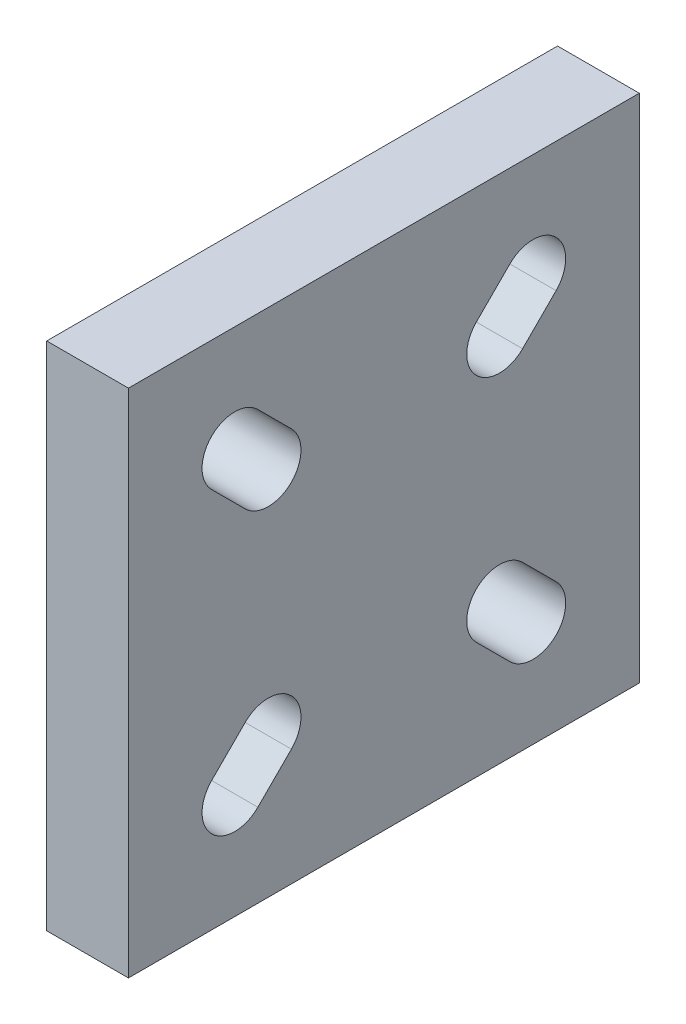
ISO-10303-21;
HEADER;
FILE_DESCRIPTION(('STEP AP214'),'2;1');
FILE_NAME('part.step','',(''),(''),'','','');
FILE_SCHEMA(('AUTOMOTIVE_DESIGN { 1 0 10303 214 1 1 1 1 }'));
ENDSEC;
DATA;
#1=APPLICATION_CONTEXT('core data for automotive mechanical design processes');
#2=APPLICATION_PROTOCOL_DEFINITION('international standard','automotive_design',2000,#1);
#3=PRODUCT_CONTEXT('',#1,'mechanical');
#4=PRODUCT('Part','Part','',(#3));
#5=PRODUCT_RELATED_PRODUCT_CATEGORY('part','',(#4));
#6=PRODUCT_DEFINITION_FORMATION('','',#4);
#7=PRODUCT_DEFINITION_CONTEXT('part definition',#1,'design');
#8=PRODUCT_DEFINITION('design','',#6,#7);
#9=PRODUCT_DEFINITION_SHAPE('','',#8);
#10=(LENGTH_UNIT() NAMED_UNIT(*) SI_UNIT(.MILLI.,.METRE.));
#11=(NAMED_UNIT(*) PLANE_ANGLE_UNIT() SI_UNIT($,.RADIAN.));
#12=(NAMED_UNIT(*) SI_UNIT($,.STERADIAN.) SOLID_ANGLE_UNIT());
#13=UNCERTAINTY_MEASURE_WITH_UNIT(LENGTH_MEASURE(1.E-05),#10,'distance_accuracy_value','');
#14=(GEOMETRIC_REPRESENTATION_CONTEXT(3) GLOBAL_UNCERTAINTY_ASSIGNED_CONTEXT((#13)) GLOBAL_UNIT_ASSIGNED_CONTEXT((#10,
#11,#12)) REPRESENTATION_CONTEXT('',''));
#15=CARTESIAN_POINT('',(0.,0.,0.));
#16=DIRECTION('',(0.,0.,1.));
#17=DIRECTION('',(1.,0.,0.));
#18=AXIS2_PLACEMENT_3D('',#15,#16,#17);
#19=CARTESIAN_POINT('',(4.,-12.5000000000001,0.));
#20=DIRECTION('',(0.,1.,0.));
#21=DIRECTION('',(0.,0.,1.));
#22=AXIS2_PLACEMENT_3D('',#19,#20,#21);
#23=PLANE('',#22);
#24=DIRECTION('',(0.,0.,-1.));
#25=VECTOR('',#24,1.);
#26=CARTESIAN_POINT('',(0.,-12.5000000000001,0.));
#27=LINE('',#26,#25);
#28=CARTESIAN_POINT('',(0.,-12.5000000000001,12.5000000000001));
#29=VERTEX_POINT('',#28);
#30=CARTESIAN_POINT('',(0.,-12.5000000000001,-12.5000000000001));
#31=VERTEX_POINT('',#30);
#32=EDGE_CURVE('E278',#29,#31,#27,.T.);
#33=ORIENTED_EDGE('',*,*,#32,.T.);
#34=DIRECTION('',(-1.,0.,0.));
#35=VECTOR('',#34,1.);
#36=CARTESIAN_POINT('',(4.,-12.5000000000001,-12.5000000000001));
#37=LINE('',#36,#35);
#38=CARTESIAN_POINT('',(4.,-12.5000000000001,-12.5000000000001));
#39=VERTEX_POINT('',#38);
#40=EDGE_CURVE('E11',#39,#31,#37,.T.);
#41=ORIENTED_EDGE('',*,*,#40,.F.);
#42=DIRECTION('',(0.,0.,-1.));
#43=VECTOR('',#42,1.);
#44=CARTESIAN_POINT('',(4.,-12.5000000000001,0.));
#45=LINE('',#44,#43);
#46=CARTESIAN_POINT('',(4.,-12.5000000000001,12.5000000000001));
#47=VERTEX_POINT('',#46);
#48=EDGE_CURVE('E193',#47,#39,#45,.T.);
#49=ORIENTED_EDGE('',*,*,#48,.F.);
#50=DIRECTION('',(-1.,0.,0.));
#51=VECTOR('',#50,1.);
#52=CARTESIAN_POINT('',(4.,-12.5000000000001,12.5000000000001));
#53=LINE('',#52,#51);
#54=EDGE_CURVE('E61',#47,#29,#53,.T.);
#55=ORIENTED_EDGE('',*,*,#54,.T.);
#56=EDGE_LOOP('',(#33,#41,#49,#55));
#57=FACE_BOUND('',#56,.T.);
#58=ADVANCED_FACE('F41',(#57),#23,.F.);
#59=CARTESIAN_POINT('',(4.,0.,-12.5000000000001));
#60=DIRECTION('',(0.,0.,1.));
#61=DIRECTION('',(1.,0.,0.));
#62=AXIS2_PLACEMENT_3D('',#59,#60,#61);
#63=PLANE('',#62);
#64=DIRECTION('',(0.,1.,0.));
#65=VECTOR('',#64,1.);
#66=CARTESIAN_POINT('',(0.,0.,-12.5000000000001));
#67=LINE('',#66,#65);
#68=CARTESIAN_POINT('',(0.,12.5000000000001,-12.5000000000001));
#69=VERTEX_POINT('',#68);
#70=EDGE_CURVE('E200',#31,#69,#67,.T.);
#71=ORIENTED_EDGE('',*,*,#70,.T.);
#72=DIRECTION('',(-1.,0.,0.));
#73=VECTOR('',#72,1.);
#74=CARTESIAN_POINT('',(4.,12.5000000000001,-12.5000000000001));
#75=LINE('',#74,#73);
#76=CARTESIAN_POINT('',(4.,12.5000000000001,-12.5000000000001));
#77=VERTEX_POINT('',#76);
#78=EDGE_CURVE('E52',#77,#69,#75,.T.);
#79=ORIENTED_EDGE('',*,*,#78,.F.);
#80=DIRECTION('',(0.,1.,0.));
#81=VECTOR('',#80,1.);
#82=CARTESIAN_POINT('',(4.,0.,-12.5000000000001));
#83=LINE('',#82,#81);
#84=EDGE_CURVE('E187',#39,#77,#83,.T.);
#85=ORIENTED_EDGE('',*,*,#84,.F.);
#86=ORIENTED_EDGE('',*,*,#40,.T.);
#87=EDGE_LOOP('',(#71,#79,#85,#86));
#88=FACE_BOUND('',#87,.T.);
#89=ADVANCED_FACE('F199',(#88),#63,.F.);
#90=CARTESIAN_POINT('',(4.,12.5000000000001,0.));
#91=DIRECTION('',(0.,1.,0.));
#92=DIRECTION('',(0.,0.,1.));
#93=AXIS2_PLACEMENT_3D('',#90,#91,#92);
#94=PLANE('',#93);
#95=DIRECTION('',(0.,0.,-1.));
#96=VECTOR('',#95,1.);
#97=CARTESIAN_POINT('',(0.,12.5000000000001,0.));
#98=LINE('',#97,#96);
#99=CARTESIAN_POINT('',(0.,12.5000000000001,12.5000000000001));
#100=VERTEX_POINT('',#99);
#101=EDGE_CURVE('E283',#100,#69,#98,.T.);
#102=ORIENTED_EDGE('',*,*,#101,.F.);
#103=DIRECTION('',(-1.,0.,0.));
#104=VECTOR('',#103,1.);
#105=CARTESIAN_POINT('',(4.,12.5000000000001,12.5000000000001));
#106=LINE('',#105,#104);
#107=CARTESIAN_POINT('',(4.,12.5000000000001,12.5000000000001));
#108=VERTEX_POINT('',#107);
#109=EDGE_CURVE('E123',#108,#100,#106,.T.);
#110=ORIENTED_EDGE('',*,*,#109,.F.);
#111=DIRECTION('',(0.,0.,-1.));
#112=VECTOR('',#111,1.);
#113=CARTESIAN_POINT('',(4.,12.5000000000001,0.));
#114=LINE('',#113,#112);
#115=EDGE_CURVE('E192',#108,#77,#114,.T.);
#116=ORIENTED_EDGE('',*,*,#115,.T.);
#117=ORIENTED_EDGE('',*,*,#78,.T.);
#118=EDGE_LOOP('',(#102,#110,#116,#117));
#119=FACE_BOUND('',#118,.T.);
#120=ADVANCED_FACE('F205',(#119),#94,.T.);
#121=CARTESIAN_POINT('',(4.,5.65685424949241,-5.65685424949241));
#122=DIRECTION('',(-1.,0.,0.));
#123=DIRECTION('',(0.,0.,1.));
#124=AXIS2_PLACEMENT_3D('',#121,#122,#123);
#125=CYLINDRICAL_SURFACE('',#124,1.6);
#126=CARTESIAN_POINT('',(0.,5.65685424949241,-5.65685424949241));
#127=DIRECTION('',(1.,0.,0.));
#128=DIRECTION('',(0.,0.,-1.));
#129=AXIS2_PLACEMENT_3D('',#126,#127,#128);
#130=CIRCLE('',#129,1.6);
#131=CARTESIAN_POINT('',(0.,6.78822509939089,-4.52548339959394));
#132=VERTEX_POINT('',#131);
#133=CARTESIAN_POINT('',(0.,4.52548339959394,-6.78822509939089));
#134=VERTEX_POINT('',#133);
#135=EDGE_CURVE('E262',#132,#134,#130,.T.);
#136=ORIENTED_EDGE('',*,*,#135,.F.);
#137=DIRECTION('',(-1.,0.,0.));
#138=VECTOR('',#137,1.);
#139=CARTESIAN_POINT('',(4.,6.78822509939089,-4.52548339959394));
#140=LINE('',#139,#138);
#141=CARTESIAN_POINT('',(4.,6.78822509939089,-4.52548339959394));
#142=VERTEX_POINT('',#141);
#143=EDGE_CURVE('E293',#142,#132,#140,.T.);
#144=ORIENTED_EDGE('',*,*,#143,.F.);
#145=CARTESIAN_POINT('',(4.,5.65685424949241,-5.65685424949241));
#146=DIRECTION('',(1.,0.,0.));
#147=DIRECTION('',(0.,0.,-1.));
#148=AXIS2_PLACEMENT_3D('',#145,#146,#147);
#149=CIRCLE('',#148,1.6);
#150=CARTESIAN_POINT('',(4.,4.52548339959394,-6.78822509939089));
#151=VERTEX_POINT('',#150);
#152=EDGE_CURVE('E399',#142,#151,#149,.T.);
#153=ORIENTED_EDGE('',*,*,#152,.T.);
#154=DIRECTION('',(-1.,0.,0.));
#155=VECTOR('',#154,1.);
#156=CARTESIAN_POINT('',(4.,4.52548339959394,-6.78822509939089));
#157=LINE('',#156,#155);
#158=EDGE_CURVE('E296',#151,#134,#157,.T.);
#159=ORIENTED_EDGE('',*,*,#158,.T.);
#160=EDGE_LOOP('',(#136,#144,#153,#159));
#161=FACE_BOUND('',#160,.T.);
#162=ADVANCED_FACE('F425',(#161),#125,.F.);
#163=CARTESIAN_POINT('',(4.,1.13137084989849,1.13137084989848));
#164=DIRECTION('',(0.,-0.707106781186548,-0.707106781186547));
#165=DIRECTION('',(0.,0.707106781186547,-0.707106781186548));
#166=AXIS2_PLACEMENT_3D('',#163,#164,#165);
#167=PLANE('',#166);
#168=DIRECTION('',(0.,-0.707106781186547,0.707106781186548));
#169=VECTOR('',#168,1.);
#170=CARTESIAN_POINT('',(0.,1.13137084989849,1.13137084989848));
#171=LINE('',#170,#169);
#172=CARTESIAN_POINT('',(0.,8.42881571831822,-6.16607401852127));
#173=VERTEX_POINT('',#172);
#174=EDGE_CURVE('E266',#173,#132,#171,.T.);
#175=ORIENTED_EDGE('',*,*,#174,.F.);
#176=DIRECTION('',(-1.,0.,0.));
#177=VECTOR('',#176,1.);
#178=CARTESIAN_POINT('',(4.,8.42881571831822,-6.16607401852127));
#179=LINE('',#178,#177);
#180=CARTESIAN_POINT('',(4.,8.42881571831822,-6.16607401852127));
#181=VERTEX_POINT('',#180);
#182=EDGE_CURVE('E303',#181,#173,#179,.T.);
#183=ORIENTED_EDGE('',*,*,#182,.F.);
#184=DIRECTION('',(0.,-0.707106781186547,0.707106781186548));
#185=VECTOR('',#184,1.);
#186=CARTESIAN_POINT('',(4.,1.13137084989849,1.13137084989848));
#187=LINE('',#186,#185);
#188=EDGE_CURVE('E403',#181,#142,#187,.T.);
#189=ORIENTED_EDGE('',*,*,#188,.T.);
#190=ORIENTED_EDGE('',*,*,#143,.T.);
#191=EDGE_LOOP('',(#175,#183,#189,#190));
#192=FACE_BOUND('',#191,.T.);
#193=ADVANCED_FACE('F428',(#192),#167,.T.);
#194=CARTESIAN_POINT('',(4.,7.29744486841974,-7.29744486841974));
#195=DIRECTION('',(-1.,0.,0.));
#196=DIRECTION('',(0.,0.,1.));
#197=AXIS2_PLACEMENT_3D('',#194,#195,#196);
#198=CYLINDRICAL_SURFACE('',#197,1.6);
#199=CARTESIAN_POINT('',(0.,7.29744486841974,-7.29744486841974));
#200=DIRECTION('',(1.,0.,0.));
#201=DIRECTION('',(0.,0.,-1.));
#202=AXIS2_PLACEMENT_3D('',#199,#200,#201);
#203=CIRCLE('',#202,1.6);
#204=CARTESIAN_POINT('',(0.,6.16607401852126,-8.42881571831822));
#205=VERTEX_POINT('',#204);
#206=EDGE_CURVE('E270',#205,#173,#203,.T.);
#207=ORIENTED_EDGE('',*,*,#206,.F.);
#208=DIRECTION('',(-1.,0.,0.));
#209=VECTOR('',#208,1.);
#210=CARTESIAN_POINT('',(4.,6.16607401852126,-8.42881571831822));
#211=LINE('',#210,#209);
#212=CARTESIAN_POINT('',(4.,6.16607401852126,-8.42881571831822));
#213=VERTEX_POINT('',#212);
#214=EDGE_CURVE('E299',#213,#205,#211,.T.);
#215=ORIENTED_EDGE('',*,*,#214,.F.);
#216=CARTESIAN_POINT('',(4.,7.29744486841974,-7.29744486841974));
#217=DIRECTION('',(1.,0.,0.));
#218=DIRECTION('',(0.,0.,-1.));
#219=AXIS2_PLACEMENT_3D('',#216,#217,#218);
#220=CIRCLE('',#219,1.6);
#221=EDGE_CURVE('E407',#213,#181,#220,.T.);
#222=ORIENTED_EDGE('',*,*,#221,.T.);
#223=ORIENTED_EDGE('',*,*,#182,.T.);
#224=EDGE_LOOP('',(#207,#215,#222,#223));
#225=FACE_BOUND('',#224,.T.);
#226=ADVANCED_FACE('F431',(#225),#198,.F.);
#227=CARTESIAN_POINT('',(4.,-5.65685424949235,-5.65685424949379));
#228=DIRECTION('',(-1.,0.,0.));
#229=DIRECTION('',(0.,0.,1.));
#230=AXIS2_PLACEMENT_3D('',#227,#228,#229);
#231=CYLINDRICAL_SURFACE('',#230,1.6);
#232=CARTESIAN_POINT('',(0.,-5.65685424949235,-5.65685424949379));
#233=DIRECTION('',(1.,0.,0.));
#234=DIRECTION('',(0.,0.,-1.));
#235=AXIS2_PLACEMENT_3D('',#232,#233,#234);
#236=CIRCLE('',#235,1.6);
#237=CARTESIAN_POINT('',(0.,-4.52548339959388,-6.78822509939227));
#238=VERTEX_POINT('',#237);
#239=CARTESIAN_POINT('',(0.,-6.78822509939083,-4.52548339959532));
#240=VERTEX_POINT('',#239);
#241=EDGE_CURVE('E246',#238,#240,#236,.T.);
#242=ORIENTED_EDGE('',*,*,#241,.F.);
#243=DIRECTION('',(-1.,0.,0.));
#244=VECTOR('',#243,1.);
#245=CARTESIAN_POINT('',(4.,-4.52548339959388,-6.78822509939227));
#246=LINE('',#245,#244);
#247=CARTESIAN_POINT('',(4.,-4.52548339959388,-6.78822509939227));
#248=VERTEX_POINT('',#247);
#249=EDGE_CURVE('E300',#248,#238,#246,.T.);
#250=ORIENTED_EDGE('',*,*,#249,.F.);
#251=CARTESIAN_POINT('',(4.,-5.65685424949235,-5.65685424949379));
#252=DIRECTION('',(1.,0.,0.));
#253=DIRECTION('',(0.,0.,-1.));
#254=AXIS2_PLACEMENT_3D('',#251,#252,#253);
#255=CIRCLE('',#254,1.6);
#256=CARTESIAN_POINT('',(4.,-6.78822509939083,-4.52548339959532));
#257=VERTEX_POINT('',#256);
#258=EDGE_CURVE('E384',#248,#257,#255,.T.);
#259=ORIENTED_EDGE('',*,*,#258,.T.);
#260=DIRECTION('',(-1.,0.,0.));
#261=VECTOR('',#260,1.);
#262=CARTESIAN_POINT('',(4.,-6.78822509939083,-4.52548339959532));
#263=LINE('',#262,#261);
#264=EDGE_CURVE('E308',#257,#240,#263,.T.);
#265=ORIENTED_EDGE('',*,*,#264,.T.);
#266=EDGE_LOOP('',(#242,#250,#259,#265));
#267=FACE_BOUND('',#266,.T.);
#268=ADVANCED_FACE('F459',(#267),#231,.F.);
#269=CARTESIAN_POINT('',(4.,1.1313708498992,-1.1313708498992));
#270=DIRECTION('',(0.,-0.707106781186547,0.707106781186548));
#271=DIRECTION('',(0.,-0.707106781186548,-0.707106781186547));
#272=AXIS2_PLACEMENT_3D('',#269,#270,#271);
#273=PLANE('',#272);
#274=DIRECTION('',(0.,0.707106781186548,0.707106781186547));
#275=VECTOR('',#274,1.);
#276=CARTESIAN_POINT('',(0.,1.1313708498992,-1.1313708498992));
#277=LINE('',#276,#275);
#278=CARTESIAN_POINT('',(0.,-6.16607401852121,-8.4288157183196));
#279=VERTEX_POINT('',#278);
#280=EDGE_CURVE('E250',#279,#238,#277,.T.);
#281=ORIENTED_EDGE('',*,*,#280,.F.);
#282=DIRECTION('',(-1.,0.,0.));
#283=VECTOR('',#282,1.);
#284=CARTESIAN_POINT('',(4.,-6.16607401852121,-8.4288157183196));
#285=LINE('',#284,#283);
#286=CARTESIAN_POINT('',(4.,-6.16607401852121,-8.4288157183196));
#287=VERTEX_POINT('',#286);
#288=EDGE_CURVE('E315',#287,#279,#285,.T.);
#289=ORIENTED_EDGE('',*,*,#288,.F.);
#290=DIRECTION('',(0.,0.707106781186548,0.707106781186547));
#291=VECTOR('',#290,1.);
#292=CARTESIAN_POINT('',(4.,1.1313708498992,-1.1313708498992));
#293=LINE('',#292,#291);
#294=EDGE_CURVE('E388',#287,#248,#293,.T.);
#295=ORIENTED_EDGE('',*,*,#294,.T.);
#296=ORIENTED_EDGE('',*,*,#249,.T.);
#297=EDGE_LOOP('',(#281,#289,#295,#296));
#298=FACE_BOUND('',#297,.T.);
#299=ADVANCED_FACE('F471',(#298),#273,.T.);
#300=CARTESIAN_POINT('',(4.,-7.29744486841968,-7.29744486842112));
#301=DIRECTION('',(-1.,0.,0.));
#302=DIRECTION('',(0.,0.,1.));
#303=AXIS2_PLACEMENT_3D('',#300,#301,#302);
#304=CYLINDRICAL_SURFACE('',#303,1.6);
#305=CARTESIAN_POINT('',(0.,-7.29744486841968,-7.29744486842112));
#306=DIRECTION('',(1.,0.,0.));
#307=DIRECTION('',(0.,0.,-1.));
#308=AXIS2_PLACEMENT_3D('',#305,#306,#307);
#309=CIRCLE('',#308,1.6);
#310=CARTESIAN_POINT('',(0.,-8.42881571831816,-6.16607401852264));
#311=VERTEX_POINT('',#310);
#312=EDGE_CURVE('E254',#311,#279,#309,.T.);
#313=ORIENTED_EDGE('',*,*,#312,.F.);
#314=DIRECTION('',(-1.,0.,0.));
#315=VECTOR('',#314,1.);
#316=CARTESIAN_POINT('',(4.,-8.42881571831816,-6.16607401852264));
#317=LINE('',#316,#315);
#318=CARTESIAN_POINT('',(4.,-8.42881571831816,-6.16607401852264));
#319=VERTEX_POINT('',#318);
#320=EDGE_CURVE('E311',#319,#311,#317,.T.);
#321=ORIENTED_EDGE('',*,*,#320,.F.);
#322=CARTESIAN_POINT('',(4.,-7.29744486841968,-7.29744486842112));
#323=DIRECTION('',(1.,0.,0.));
#324=DIRECTION('',(0.,0.,-1.));
#325=AXIS2_PLACEMENT_3D('',#322,#323,#324);
#326=CIRCLE('',#325,1.6);
#327=EDGE_CURVE('E392',#319,#287,#326,.T.);
#328=ORIENTED_EDGE('',*,*,#327,.T.);
#329=ORIENTED_EDGE('',*,*,#288,.T.);
#330=EDGE_LOOP('',(#313,#321,#328,#329));
#331=FACE_BOUND('',#330,.T.);
#332=ADVANCED_FACE('F467',(#331),#304,.F.);
#333=CARTESIAN_POINT('',(4.,-5.65685424949373,5.65685424949097));
#334=DIRECTION('',(-1.,0.,0.));
#335=DIRECTION('',(0.,0.,1.));
#336=AXIS2_PLACEMENT_3D('',#333,#334,#335);
#337=CYLINDRICAL_SURFACE('',#336,1.6);
#338=CARTESIAN_POINT('',(0.,-5.65685424949373,5.65685424949097));
#339=DIRECTION('',(1.,0.,0.));
#340=DIRECTION('',(0.,0.,-1.));
#341=AXIS2_PLACEMENT_3D('',#338,#339,#340);
#342=CIRCLE('',#341,1.6);
#343=CARTESIAN_POINT('',(0.,-6.78822509939221,4.5254833995925));
#344=VERTEX_POINT('',#343);
#345=CARTESIAN_POINT('',(0.,-4.52548339959526,6.78822509938945));
#346=VERTEX_POINT('',#345);
#347=EDGE_CURVE('E230',#344,#346,#342,.T.);
#348=ORIENTED_EDGE('',*,*,#347,.F.);
#349=DIRECTION('',(-1.,0.,0.));
#350=VECTOR('',#349,1.);
#351=CARTESIAN_POINT('',(4.,-6.78822509939221,4.5254833995925));
#352=LINE('',#351,#350);
#353=CARTESIAN_POINT('',(4.,-6.78822509939221,4.5254833995925));
#354=VERTEX_POINT('',#353);
#355=EDGE_CURVE('E312',#354,#344,#352,.T.);
#356=ORIENTED_EDGE('',*,*,#355,.F.);
#357=CARTESIAN_POINT('',(4.,-5.65685424949373,5.65685424949097));
#358=DIRECTION('',(1.,0.,0.));
#359=DIRECTION('',(0.,0.,-1.));
#360=AXIS2_PLACEMENT_3D('',#357,#358,#359);
#361=CIRCLE('',#360,1.6);
#362=CARTESIAN_POINT('',(4.,-4.52548339959526,6.78822509938945));
#363=VERTEX_POINT('',#362);
#364=EDGE_CURVE('E361',#354,#363,#361,.T.);
#365=ORIENTED_EDGE('',*,*,#364,.T.);
#366=DIRECTION('',(-1.,0.,0.));
#367=VECTOR('',#366,1.);
#368=CARTESIAN_POINT('',(4.,-4.52548339959526,6.78822509938945));
#369=LINE('',#368,#367);
#370=EDGE_CURVE('E320',#363,#346,#369,.T.);
#371=ORIENTED_EDGE('',*,*,#370,.T.);
#372=EDGE_LOOP('',(#348,#356,#365,#371));
#373=FACE_BOUND('',#372,.T.);
#374=ADVANCED_FACE('F470',(#373),#337,.F.);
#375=CARTESIAN_POINT('',(4.,-1.13137084989986,-1.13137084989986));
#376=DIRECTION('',(0.,0.707106781186548,0.707106781186547));
#377=DIRECTION('',(0.,-0.707106781186547,0.707106781186548));
#378=AXIS2_PLACEMENT_3D('',#375,#376,#377);
#379=PLANE('',#378);
#380=DIRECTION('',(0.,0.707106781186547,-0.707106781186548));
#381=VECTOR('',#380,1.);
#382=CARTESIAN_POINT('',(0.,-1.13137084989986,-1.13137084989986));
#383=LINE('',#382,#381);
#384=CARTESIAN_POINT('',(0.,-8.42881571831954,6.16607401851983));
#385=VERTEX_POINT('',#384);
#386=EDGE_CURVE('E234',#385,#344,#383,.T.);
#387=ORIENTED_EDGE('',*,*,#386,.F.);
#388=DIRECTION('',(-1.,0.,0.));
#389=VECTOR('',#388,1.);
#390=CARTESIAN_POINT('',(4.,-8.42881571831954,6.16607401851983));
#391=LINE('',#390,#389);
#392=CARTESIAN_POINT('',(4.,-8.42881571831954,6.16607401851983));
#393=VERTEX_POINT('',#392);
#394=EDGE_CURVE('E326',#393,#385,#391,.T.);
#395=ORIENTED_EDGE('',*,*,#394,.F.);
#396=DIRECTION('',(0.,0.707106781186547,-0.707106781186548));
#397=VECTOR('',#396,1.);
#398=CARTESIAN_POINT('',(4.,-1.13137084989986,-1.13137084989986));
#399=LINE('',#398,#397);
#400=EDGE_CURVE('E373',#393,#354,#399,.T.);
#401=ORIENTED_EDGE('',*,*,#400,.T.);
#402=ORIENTED_EDGE('',*,*,#355,.T.);
#403=EDGE_LOOP('',(#387,#395,#401,#402));
#404=FACE_BOUND('',#403,.T.);
#405=ADVANCED_FACE('F485',(#404),#379,.T.);
#406=CARTESIAN_POINT('',(4.,-7.29744486842106,7.2974448684183));
#407=DIRECTION('',(-1.,0.,0.));
#408=DIRECTION('',(0.,0.,1.));
#409=AXIS2_PLACEMENT_3D('',#406,#407,#408);
#410=CYLINDRICAL_SURFACE('',#409,1.6);
#411=CARTESIAN_POINT('',(0.,-7.29744486842106,7.2974448684183));
#412=DIRECTION('',(1.,0.,0.));
#413=DIRECTION('',(0.,0.,-1.));
#414=AXIS2_PLACEMENT_3D('',#411,#412,#413);
#415=CIRCLE('',#414,1.6);
#416=CARTESIAN_POINT('',(0.,-6.16607401852258,8.42881571831678));
#417=VERTEX_POINT('',#416);
#418=EDGE_CURVE('E238',#417,#385,#415,.T.);
#419=ORIENTED_EDGE('',*,*,#418,.F.);
#420=DIRECTION('',(-1.,0.,0.));
#421=VECTOR('',#420,1.);
#422=CARTESIAN_POINT('',(4.,-6.16607401852258,8.42881571831678));
#423=LINE('',#422,#421);
#424=CARTESIAN_POINT('',(4.,-6.16607401852258,8.42881571831678));
#425=VERTEX_POINT('',#424);
#426=EDGE_CURVE('E323',#425,#417,#423,.T.);
#427=ORIENTED_EDGE('',*,*,#426,.F.);
#428=CARTESIAN_POINT('',(4.,-7.29744486842106,7.2974448684183));
#429=DIRECTION('',(1.,0.,0.));
#430=DIRECTION('',(0.,0.,-1.));
#431=AXIS2_PLACEMENT_3D('',#428,#429,#430);
#432=CIRCLE('',#431,1.6);
#433=EDGE_CURVE('E377',#425,#393,#432,.T.);
#434=ORIENTED_EDGE('',*,*,#433,.T.);
#435=ORIENTED_EDGE('',*,*,#394,.T.);
#436=EDGE_LOOP('',(#419,#427,#434,#435));
#437=FACE_BOUND('',#436,.T.);
#438=ADVANCED_FACE('F482',(#437),#410,.F.);
#439=CARTESIAN_POINT('',(4.,5.65685424949104,5.65685424949235));
#440=DIRECTION('',(-1.,0.,0.));
#441=DIRECTION('',(0.,0.,1.));
#442=AXIS2_PLACEMENT_3D('',#439,#440,#441);
#443=CYLINDRICAL_SURFACE('',#442,1.6);
#444=CARTESIAN_POINT('',(0.,5.65685424949104,5.65685424949235));
#445=DIRECTION('',(1.,0.,0.));
#446=DIRECTION('',(0.,0.,-1.));
#447=AXIS2_PLACEMENT_3D('',#444,#445,#446);
#448=CIRCLE('',#447,1.6);
#449=CARTESIAN_POINT('',(0.,4.52548339959256,6.78822509939083));
#450=VERTEX_POINT('',#449);
#451=CARTESIAN_POINT('',(0.,6.78822509938951,4.52548339959388));
#452=VERTEX_POINT('',#451);
#453=EDGE_CURVE('E214',#450,#452,#448,.T.);
#454=ORIENTED_EDGE('',*,*,#453,.F.);
#455=DIRECTION('',(-1.,0.,0.));
#456=VECTOR('',#455,1.);
#457=CARTESIAN_POINT('',(4.,4.52548339959256,6.78822509939083));
#458=LINE('',#457,#456);
#459=CARTESIAN_POINT('',(4.,4.52548339959256,6.78822509939083));
#460=VERTEX_POINT('',#459);
#461=EDGE_CURVE('E45',#460,#450,#458,.T.);
#462=ORIENTED_EDGE('',*,*,#461,.F.);
#463=CARTESIAN_POINT('',(4.,5.65685424949104,5.65685424949235));
#464=DIRECTION('',(1.,0.,0.));
#465=DIRECTION('',(0.,0.,-1.));
#466=AXIS2_PLACEMENT_3D('',#463,#464,#465);
#467=CIRCLE('',#466,1.6);
#468=CARTESIAN_POINT('',(4.,6.78822509938951,4.52548339959388));
#469=VERTEX_POINT('',#468);
#470=EDGE_CURVE('E290',#460,#469,#467,.T.);
#471=ORIENTED_EDGE('',*,*,#470,.T.);
#472=DIRECTION('',(-1.,0.,0.));
#473=VECTOR('',#472,1.);
#474=CARTESIAN_POINT('',(4.,6.78822509938951,4.52548339959388));
#475=LINE('',#474,#473);
#476=EDGE_CURVE('E210',#469,#452,#475,.T.);
#477=ORIENTED_EDGE('',*,*,#476,.T.);
#478=EDGE_LOOP('',(#454,#462,#471,#477));
#479=FACE_BOUND('',#478,.T.);
#480=ADVANCED_FACE('F43',(#479),#443,.F.);
#481=CARTESIAN_POINT('',(4.,-1.13137084989913,1.13137084989913));
#482=DIRECTION('',(0.,0.707106781186547,-0.707106781186547));
#483=DIRECTION('',(0.,0.707106781186548,0.707106781186548));
#484=AXIS2_PLACEMENT_3D('',#481,#482,#483);
#485=PLANE('',#484);
#486=DIRECTION('',(0.,-0.707106781186548,-0.707106781186548));
#487=VECTOR('',#486,1.);
#488=CARTESIAN_POINT('',(0.,-1.13137084989913,1.13137084989913));
#489=LINE('',#488,#487);
#490=CARTESIAN_POINT('',(0.,6.16607401851989,8.42881571831816));
#491=VERTEX_POINT('',#490);
#492=EDGE_CURVE('E218',#491,#450,#489,.T.);
#493=ORIENTED_EDGE('',*,*,#492,.F.);
#494=DIRECTION('',(-1.,0.,0.));
#495=VECTOR('',#494,1.);
#496=CARTESIAN_POINT('',(4.,6.16607401851989,8.42881571831816));
#497=LINE('',#496,#495);
#498=CARTESIAN_POINT('',(4.,6.16607401851989,8.42881571831816));
#499=VERTEX_POINT('',#498);
#500=EDGE_CURVE('E335',#499,#491,#497,.T.);
#501=ORIENTED_EDGE('',*,*,#500,.F.);
#502=DIRECTION('',(0.,-0.707106781186548,-0.707106781186548));
#503=VECTOR('',#502,1.);
#504=CARTESIAN_POINT('',(4.,-1.13137084989913,1.13137084989913));
#505=LINE('',#504,#503);
#506=EDGE_CURVE('E346',#499,#460,#505,.T.);
#507=ORIENTED_EDGE('',*,*,#506,.T.);
#508=ORIENTED_EDGE('',*,*,#461,.T.);
#509=EDGE_LOOP('',(#493,#501,#507,#508));
#510=FACE_BOUND('',#509,.T.);
#511=ADVANCED_FACE('F344',(#510),#485,.T.);
#512=CARTESIAN_POINT('',(4.,7.29744486841837,7.29744486841968));
#513=DIRECTION('',(-1.,0.,0.));
#514=DIRECTION('',(0.,0.,1.));
#515=AXIS2_PLACEMENT_3D('',#512,#513,#514);
#516=CYLINDRICAL_SURFACE('',#515,1.6);
#517=CARTESIAN_POINT('',(0.,7.29744486841837,7.29744486841968));
#518=DIRECTION('',(1.,0.,0.));
#519=DIRECTION('',(0.,0.,-1.));
#520=AXIS2_PLACEMENT_3D('',#517,#518,#519);
#521=CIRCLE('',#520,1.6);
#522=CARTESIAN_POINT('',(0.,8.42881571831684,6.1660740185212));
#523=VERTEX_POINT('',#522);
#524=EDGE_CURVE('E222',#523,#491,#521,.T.);
#525=ORIENTED_EDGE('',*,*,#524,.F.);
#526=DIRECTION('',(-1.,0.,0.));
#527=VECTOR('',#526,1.);
#528=CARTESIAN_POINT('',(4.,8.42881571831684,6.1660740185212));
#529=LINE('',#528,#527);
#530=CARTESIAN_POINT('',(4.,8.42881571831684,6.1660740185212));
#531=VERTEX_POINT('',#530);
#532=EDGE_CURVE('E333',#531,#523,#529,.T.);
#533=ORIENTED_EDGE('',*,*,#532,.F.);
#534=CARTESIAN_POINT('',(4.,7.29744486841837,7.29744486841968));
#535=DIRECTION('',(1.,0.,0.));
#536=DIRECTION('',(0.,0.,-1.));
#537=AXIS2_PLACEMENT_3D('',#534,#535,#536);
#538=CIRCLE('',#537,1.6);
#539=EDGE_CURVE('E355',#531,#499,#538,.T.);
#540=ORIENTED_EDGE('',*,*,#539,.T.);
#541=ORIENTED_EDGE('',*,*,#500,.T.);
#542=EDGE_LOOP('',(#525,#533,#540,#541));
#543=FACE_BOUND('',#542,.T.);
#544=ADVANCED_FACE('F352',(#543),#516,.F.);
#545=CARTESIAN_POINT('',(4.,-1.13137084989847,-1.13137084989847));
#546=DIRECTION('',(0.,-0.707106781186548,-0.707106781186547));
#547=DIRECTION('',(0.,0.707106781186547,-0.707106781186548));
#548=AXIS2_PLACEMENT_3D('',#545,#546,#547);
#549=PLANE('',#548);
#550=DIRECTION('',(0.,-0.707106781186547,0.707106781186548));
#551=VECTOR('',#550,1.);
#552=CARTESIAN_POINT('',(0.,-1.13137084989847,-1.13137084989847));
#553=LINE('',#552,#551);
#554=EDGE_CURVE('E274',#205,#134,#553,.T.);
#555=ORIENTED_EDGE('',*,*,#554,.T.);
#556=ORIENTED_EDGE('',*,*,#158,.F.);
#557=DIRECTION('',(0.,-0.707106781186547,0.707106781186548));
#558=VECTOR('',#557,1.);
#559=CARTESIAN_POINT('',(4.,-1.13137084989847,-1.13137084989847));
#560=LINE('',#559,#558);
#561=EDGE_CURVE('E411',#213,#151,#560,.T.);
#562=ORIENTED_EDGE('',*,*,#561,.F.);
#563=ORIENTED_EDGE('',*,*,#214,.T.);
#564=EDGE_LOOP('',(#555,#556,#562,#563));
#565=FACE_BOUND('',#564,.T.);
#566=ADVANCED_FACE('F421',(#565),#549,.F.);
#567=CARTESIAN_POINT('',(4.,-1.13137084989775,1.13137084989775));
#568=DIRECTION('',(0.,-0.707106781186547,0.707106781186548));
#569=DIRECTION('',(0.,-0.707106781186548,-0.707106781186547));
#570=AXIS2_PLACEMENT_3D('',#567,#568,#569);
#571=PLANE('',#570);
#572=DIRECTION('',(0.,0.707106781186548,0.707106781186547));
#573=VECTOR('',#572,1.);
#574=CARTESIAN_POINT('',(0.,-1.13137084989775,1.13137084989775));
#575=LINE('',#574,#573);
#576=EDGE_CURVE('E258',#311,#240,#575,.T.);
#577=ORIENTED_EDGE('',*,*,#576,.T.);
#578=ORIENTED_EDGE('',*,*,#264,.F.);
#579=DIRECTION('',(0.,0.707106781186548,0.707106781186547));
#580=VECTOR('',#579,1.);
#581=CARTESIAN_POINT('',(4.,-1.13137084989775,1.13137084989775));
#582=LINE('',#581,#580);
#583=EDGE_CURVE('E396',#319,#257,#582,.T.);
#584=ORIENTED_EDGE('',*,*,#583,.F.);
#585=ORIENTED_EDGE('',*,*,#320,.T.);
#586=EDGE_LOOP('',(#577,#578,#584,#585));
#587=FACE_BOUND('',#586,.T.);
#588=ADVANCED_FACE('F456',(#587),#571,.F.);
#589=CARTESIAN_POINT('',(4.,1.13137084989709,1.13137084989709));
#590=DIRECTION('',(0.,0.707106781186549,0.707106781186546));
#591=DIRECTION('',(0.,-0.707106781186546,0.707106781186549));
#592=AXIS2_PLACEMENT_3D('',#589,#590,#591);
#593=PLANE('',#592);
#594=DIRECTION('',(0.,0.707106781186546,-0.707106781186549));
#595=VECTOR('',#594,1.);
#596=CARTESIAN_POINT('',(0.,1.13137084989709,1.13137084989709));
#597=LINE('',#596,#595);
#598=EDGE_CURVE('E242',#417,#346,#597,.T.);
#599=ORIENTED_EDGE('',*,*,#598,.T.);
#600=ORIENTED_EDGE('',*,*,#370,.F.);
#601=DIRECTION('',(0.,0.707106781186546,-0.707106781186549));
#602=VECTOR('',#601,1.);
#603=CARTESIAN_POINT('',(4.,1.13137084989709,1.13137084989709));
#604=LINE('',#603,#602);
#605=EDGE_CURVE('E381',#425,#363,#604,.T.);
#606=ORIENTED_EDGE('',*,*,#605,.F.);
#607=ORIENTED_EDGE('',*,*,#426,.T.);
#608=EDGE_LOOP('',(#599,#600,#606,#607));
#609=FACE_BOUND('',#608,.T.);
#610=ADVANCED_FACE('F444',(#609),#593,.F.);
#611=CARTESIAN_POINT('',(4.,1.13137084989781,-1.13137084989781));
#612=DIRECTION('',(0.,0.707106781186547,-0.707106781186548));
#613=DIRECTION('',(0.,0.707106781186548,0.707106781186547));
#614=AXIS2_PLACEMENT_3D('',#611,#612,#613);
#615=PLANE('',#614);
#616=DIRECTION('',(0.,-0.707106781186548,-0.707106781186547));
#617=VECTOR('',#616,1.);
#618=CARTESIAN_POINT('',(0.,1.13137084989781,-1.13137084989781));
#619=LINE('',#618,#617);
#620=EDGE_CURVE('E226',#523,#452,#619,.T.);
#621=ORIENTED_EDGE('',*,*,#620,.T.);
#622=ORIENTED_EDGE('',*,*,#476,.F.);
#623=DIRECTION('',(0.,-0.707106781186548,-0.707106781186547));
#624=VECTOR('',#623,1.);
#625=CARTESIAN_POINT('',(4.,1.13137084989781,-1.13137084989781));
#626=LINE('',#625,#624);
#627=EDGE_CURVE('E357',#531,#469,#626,.T.);
#628=ORIENTED_EDGE('',*,*,#627,.F.);
#629=ORIENTED_EDGE('',*,*,#532,.T.);
#630=EDGE_LOOP('',(#621,#622,#628,#629));
#631=FACE_BOUND('',#630,.T.);
#632=ADVANCED_FACE('F358',(#631),#615,.F.);
#633=CARTESIAN_POINT('',(4.,0.,12.5000000000001));
#634=DIRECTION('',(0.,0.,1.));
#635=DIRECTION('',(0.,-1.,0.));
#636=AXIS2_PLACEMENT_3D('',#633,#634,#635);
#637=PLANE('',#636);
#638=DIRECTION('',(0.,1.,0.));
#639=VECTOR('',#638,1.);
#640=CARTESIAN_POINT('',(0.,0.,12.5000000000001));
#641=LINE('',#640,#639);
#642=EDGE_CURVE('E286',#29,#100,#641,.T.);
#643=ORIENTED_EDGE('',*,*,#642,.F.);
#644=ORIENTED_EDGE('',*,*,#54,.F.);
#645=DIRECTION('',(0.,1.,0.));
#646=VECTOR('',#645,1.);
#647=CARTESIAN_POINT('',(4.,0.,12.5000000000001));
#648=LINE('',#647,#646);
#649=EDGE_CURVE('E207',#47,#108,#648,.T.);
#650=ORIENTED_EDGE('',*,*,#649,.T.);
#651=ORIENTED_EDGE('',*,*,#109,.T.);
#652=EDGE_LOOP('',(#643,#644,#650,#651));
#653=FACE_BOUND('',#652,.T.);
#654=ADVANCED_FACE('F436',(#653),#637,.T.);
#655=CARTESIAN_POINT('',(4.,0.,0.));
#656=DIRECTION('',(1.,0.,0.));
#657=DIRECTION('',(0.,0.,-1.));
#658=AXIS2_PLACEMENT_3D('',#655,#656,#657);
#659=PLANE('',#658);
#660=ORIENTED_EDGE('',*,*,#470,.F.);
#661=ORIENTED_EDGE('',*,*,#506,.F.);
#662=ORIENTED_EDGE('',*,*,#539,.F.);
#663=ORIENTED_EDGE('',*,*,#627,.T.);
#664=EDGE_LOOP('',(#660,#661,#662,#663));
#665=FACE_BOUND('',#664,.T.);
#666=ORIENTED_EDGE('',*,*,#364,.F.);
#667=ORIENTED_EDGE('',*,*,#400,.F.);
#668=ORIENTED_EDGE('',*,*,#433,.F.);
#669=ORIENTED_EDGE('',*,*,#605,.T.);
#670=EDGE_LOOP('',(#666,#667,#668,#669));
#671=FACE_BOUND('',#670,.T.);
#672=ORIENTED_EDGE('',*,*,#258,.F.);
#673=ORIENTED_EDGE('',*,*,#294,.F.);
#674=ORIENTED_EDGE('',*,*,#327,.F.);
#675=ORIENTED_EDGE('',*,*,#583,.T.);
#676=EDGE_LOOP('',(#672,#673,#674,#675));
#677=FACE_BOUND('',#676,.T.);
#678=ORIENTED_EDGE('',*,*,#152,.F.);
#679=ORIENTED_EDGE('',*,*,#188,.F.);
#680=ORIENTED_EDGE('',*,*,#221,.F.);
#681=ORIENTED_EDGE('',*,*,#561,.T.);
#682=EDGE_LOOP('',(#678,#679,#680,#681));
#683=FACE_BOUND('',#682,.T.);
#684=ORIENTED_EDGE('',*,*,#48,.T.);
#685=ORIENTED_EDGE('',*,*,#84,.T.);
#686=ORIENTED_EDGE('',*,*,#115,.F.);
#687=ORIENTED_EDGE('',*,*,#649,.F.);
#688=EDGE_LOOP('',(#684,#685,#686,#687));
#689=FACE_BOUND('',#688,.T.);
#690=ADVANCED_FACE('F189',(#665,#671,#677,#683,#689),#659,.T.);
#691=CARTESIAN_POINT('',(0.,0.,0.));
#692=DIRECTION('',(1.,0.,0.));
#693=DIRECTION('',(0.,0.,-1.));
#694=AXIS2_PLACEMENT_3D('',#691,#692,#693);
#695=PLANE('',#694);
#696=ORIENTED_EDGE('',*,*,#453,.T.);
#697=ORIENTED_EDGE('',*,*,#620,.F.);
#698=ORIENTED_EDGE('',*,*,#524,.T.);
#699=ORIENTED_EDGE('',*,*,#492,.T.);
#700=EDGE_LOOP('',(#696,#697,#698,#699));
#701=FACE_BOUND('',#700,.T.);
#702=ORIENTED_EDGE('',*,*,#347,.T.);
#703=ORIENTED_EDGE('',*,*,#598,.F.);
#704=ORIENTED_EDGE('',*,*,#418,.T.);
#705=ORIENTED_EDGE('',*,*,#386,.T.);
#706=EDGE_LOOP('',(#702,#703,#704,#705));
#707=FACE_BOUND('',#706,.T.);
#708=ORIENTED_EDGE('',*,*,#241,.T.);
#709=ORIENTED_EDGE('',*,*,#576,.F.);
#710=ORIENTED_EDGE('',*,*,#312,.T.);
#711=ORIENTED_EDGE('',*,*,#280,.T.);
#712=EDGE_LOOP('',(#708,#709,#710,#711));
#713=FACE_BOUND('',#712,.T.);
#714=ORIENTED_EDGE('',*,*,#135,.T.);
#715=ORIENTED_EDGE('',*,*,#554,.F.);
#716=ORIENTED_EDGE('',*,*,#206,.T.);
#717=ORIENTED_EDGE('',*,*,#174,.T.);
#718=EDGE_LOOP('',(#714,#715,#716,#717));
#719=FACE_BOUND('',#718,.T.);
#720=ORIENTED_EDGE('',*,*,#32,.F.);
#721=ORIENTED_EDGE('',*,*,#642,.T.);
#722=ORIENTED_EDGE('',*,*,#101,.T.);
#723=ORIENTED_EDGE('',*,*,#70,.F.);
#724=EDGE_LOOP('',(#720,#721,#722,#723));
#725=FACE_BOUND('',#724,.T.);
#726=ADVANCED_FACE('F350',(#701,#707,#713,#719,#725),#695,.F.);
#727=CLOSED_SHELL('',(#58,#89,#120,#162,#193,#226,#268,#299,#332,#374,#405,#438,#480,#511,#544,
#566,#588,#610,#632,#654,#690,#726));
#728=MANIFOLD_SOLID_BREP('B2',#727);
#729=ADVANCED_BREP_SHAPE_REPRESENTATION('',(#18,#728),#14);
#730=SHAPE_DEFINITION_REPRESENTATION(#9,#729);
ENDSEC;
END-ISO-10303-21;
